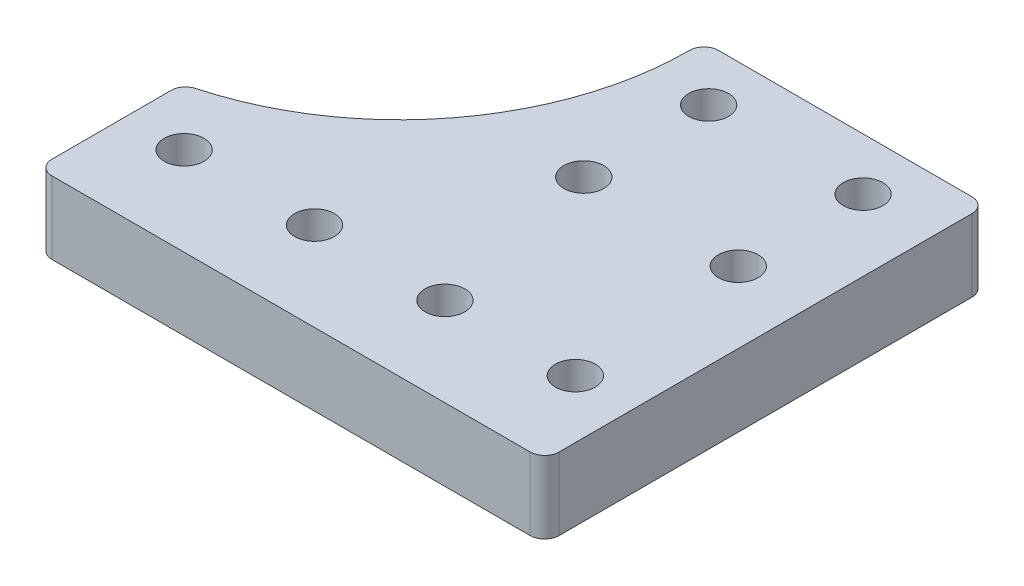
ISO-10303-21;
HEADER;
FILE_DESCRIPTION(('STEP AP214'),'2;1');
FILE_NAME('part.step','',(''),(''),'','','');
FILE_SCHEMA(('AUTOMOTIVE_DESIGN { 1 0 10303 214 1 1 1 1 }'));
ENDSEC;
DATA;
#1=APPLICATION_CONTEXT('core data for automotive mechanical design processes');
#2=APPLICATION_PROTOCOL_DEFINITION('international standard','automotive_design',2000,#1);
#3=PRODUCT_CONTEXT('',#1,'mechanical');
#4=PRODUCT('Part','Part','',(#3));
#5=PRODUCT_RELATED_PRODUCT_CATEGORY('part','',(#4));
#6=PRODUCT_DEFINITION_FORMATION('','',#4);
#7=PRODUCT_DEFINITION_CONTEXT('part definition',#1,'design');
#8=PRODUCT_DEFINITION('design','',#6,#7);
#9=PRODUCT_DEFINITION_SHAPE('','',#8);
#10=(LENGTH_UNIT() NAMED_UNIT(*) SI_UNIT(.MILLI.,.METRE.));
#11=(NAMED_UNIT(*) PLANE_ANGLE_UNIT() SI_UNIT($,.RADIAN.));
#12=(NAMED_UNIT(*) SI_UNIT($,.STERADIAN.) SOLID_ANGLE_UNIT());
#13=UNCERTAINTY_MEASURE_WITH_UNIT(LENGTH_MEASURE(1.E-05),#10,'distance_accuracy_value','');
#14=(GEOMETRIC_REPRESENTATION_CONTEXT(3) GLOBAL_UNCERTAINTY_ASSIGNED_CONTEXT((#13)) GLOBAL_UNIT_ASSIGNED_CONTEXT((#10,
#11,#12)) REPRESENTATION_CONTEXT('',''));
#15=CARTESIAN_POINT('',(0.,0.,0.));
#16=DIRECTION('',(0.,0.,1.));
#17=DIRECTION('',(1.,0.,0.));
#18=AXIS2_PLACEMENT_3D('',#15,#16,#17);
#19=CARTESIAN_POINT('',(0.,10.,-61.));
#20=DIRECTION('',(0.,0.,-1.));
#21=DIRECTION('',(-1.,0.,0.));
#22=AXIS2_PLACEMENT_3D('',#19,#20,#21);
#23=PLANE('',#22);
#24=DIRECTION('',(1.,0.,0.));
#25=VECTOR('',#24,1.);
#26=CARTESIAN_POINT('',(0.,0.,-61.));
#27=LINE('',#26,#25);
#28=CARTESIAN_POINT('',(-37.,0.,-61.));
#29=VERTEX_POINT('',#28);
#30=CARTESIAN_POINT('',(-2.,0.,-61.));
#31=VERTEX_POINT('',#30);
#32=EDGE_CURVE('E137',#29,#31,#27,.T.);
#33=ORIENTED_EDGE('',*,*,#32,.F.);
#34=DIRECTION('',(0.,-1.,0.));
#35=VECTOR('',#34,1.);
#36=CARTESIAN_POINT('',(-37.,10.,-61.));
#37=LINE('',#36,#35);
#38=CARTESIAN_POINT('',(-37.,10.,-61.));
#39=VERTEX_POINT('',#38);
#40=EDGE_CURVE('E183',#29,#39,#37,.F.);
#41=ORIENTED_EDGE('',*,*,#40,.T.);
#42=DIRECTION('',(1.,0.,0.));
#43=VECTOR('',#42,1.);
#44=CARTESIAN_POINT('',(0.,10.,-61.));
#45=LINE('',#44,#43);
#46=CARTESIAN_POINT('',(-2.,10.,-61.));
#47=VERTEX_POINT('',#46);
#48=EDGE_CURVE('E209',#39,#47,#45,.T.);
#49=ORIENTED_EDGE('',*,*,#48,.T.);
#50=DIRECTION('',(0.,-1.,0.));
#51=VECTOR('',#50,1.);
#52=CARTESIAN_POINT('',(-2.,0.,-61.));
#53=LINE('',#52,#51);
#54=EDGE_CURVE('E177',#47,#31,#53,.T.);
#55=ORIENTED_EDGE('',*,*,#54,.T.);
#56=EDGE_LOOP('',(#33,#41,#49,#55));
#57=FACE_BOUND('',#56,.T.);
#58=ADVANCED_FACE('F41',(#57),#23,.T.);
#59=CARTESIAN_POINT('',(-39.,10.,0.));
#60=DIRECTION('',(-1.,0.,0.));
#61=DIRECTION('',(0.,0.,1.));
#62=AXIS2_PLACEMENT_3D('',#59,#60,#61);
#63=PLANE('',#62);
#64=DIRECTION('',(0.,0.,-1.));
#65=VECTOR('',#64,1.);
#66=CARTESIAN_POINT('',(-39.,10.,0.));
#67=LINE('',#66,#65);
#68=CARTESIAN_POINT('',(-39.,10.,-58.9743505398101));
#69=VERTEX_POINT('',#68);
#70=CARTESIAN_POINT('',(-39.,10.,-59.));
#71=VERTEX_POINT('',#70);
#72=EDGE_CURVE('E207',#69,#71,#67,.T.);
#73=ORIENTED_EDGE('',*,*,#72,.T.);
#74=DIRECTION('',(0.,-1.,0.));
#75=VECTOR('',#74,1.);
#76=CARTESIAN_POINT('',(-39.,10.,-59.));
#77=LINE('',#76,#75);
#78=CARTESIAN_POINT('',(-39.,0.,-59.));
#79=VERTEX_POINT('',#78);
#80=EDGE_CURVE('E135',#71,#79,#77,.T.);
#81=ORIENTED_EDGE('',*,*,#80,.T.);
#82=DIRECTION('',(0.,0.,-1.));
#83=VECTOR('',#82,1.);
#84=CARTESIAN_POINT('',(-39.,0.,0.));
#85=LINE('',#84,#83);
#86=CARTESIAN_POINT('',(-39.,0.,-58.9743505398101));
#87=VERTEX_POINT('',#86);
#88=EDGE_CURVE('E124',#87,#79,#85,.T.);
#89=ORIENTED_EDGE('',*,*,#88,.F.);
#90=DIRECTION('',(0.,1.,0.));
#91=VECTOR('',#90,1.);
#92=CARTESIAN_POINT('',(-39.,10.,-58.9743505398101));
#93=LINE('',#92,#91);
#94=EDGE_CURVE('E127',#87,#69,#93,.T.);
#95=ORIENTED_EDGE('',*,*,#94,.T.);
#96=EDGE_LOOP('',(#73,#81,#89,#95));
#97=FACE_BOUND('',#96,.T.);
#98=ADVANCED_FACE('F132',(#97),#63,.T.);
#99=CARTESIAN_POINT('',(-70.,10.,0.));
#100=DIRECTION('',(1.,0.,0.));
#101=DIRECTION('',(0.,0.,-1.));
#102=AXIS2_PLACEMENT_3D('',#99,#100,#101);
#103=PLANE('',#102);
#104=DIRECTION('',(0.,0.,1.));
#105=VECTOR('',#104,1.);
#106=CARTESIAN_POINT('',(-70.,10.,0.));
#107=LINE('',#106,#105);
#108=CARTESIAN_POINT('',(-70.,10.,-18.4404141407877));
#109=VERTEX_POINT('',#108);
#110=CARTESIAN_POINT('',(-70.,10.,-1.99999999999999));
#111=VERTEX_POINT('',#110);
#112=EDGE_CURVE('E194',#109,#111,#107,.T.);
#113=ORIENTED_EDGE('',*,*,#112,.F.);
#114=DIRECTION('',(0.,-1.,0.));
#115=VECTOR('',#114,1.);
#116=CARTESIAN_POINT('',(-70.,10.,-18.4404141407877));
#117=LINE('',#116,#115);
#118=CARTESIAN_POINT('',(-70.,0.,-18.4404141407877));
#119=VERTEX_POINT('',#118);
#120=EDGE_CURVE('E187',#109,#119,#117,.T.);
#121=ORIENTED_EDGE('',*,*,#120,.T.);
#122=DIRECTION('',(0.,0.,1.));
#123=VECTOR('',#122,1.);
#124=CARTESIAN_POINT('',(-70.,0.,0.));
#125=LINE('',#124,#123);
#126=CARTESIAN_POINT('',(-70.,0.,-1.99999999999999));
#127=VERTEX_POINT('',#126);
#128=EDGE_CURVE('E136',#119,#127,#125,.T.);
#129=ORIENTED_EDGE('',*,*,#128,.T.);
#130=DIRECTION('',(0.,-1.,0.));
#131=VECTOR('',#130,1.);
#132=CARTESIAN_POINT('',(-70.,10.,-1.99999999999999));
#133=LINE('',#132,#131);
#134=EDGE_CURVE('E174',#127,#111,#133,.F.);
#135=ORIENTED_EDGE('',*,*,#134,.T.);
#136=EDGE_LOOP('',(#113,#121,#129,#135));
#137=FACE_BOUND('',#136,.T.);
#138=ADVANCED_FACE('F193',(#137),#103,.F.);
#139=CARTESIAN_POINT('',(0.,10.,0.));
#140=DIRECTION('',(0.,0.,1.));
#141=DIRECTION('',(1.,0.,0.));
#142=AXIS2_PLACEMENT_3D('',#139,#140,#141);
#143=PLANE('',#142);
#144=DIRECTION('',(-1.,0.,0.));
#145=VECTOR('',#144,1.);
#146=CARTESIAN_POINT('',(0.,0.,0.));
#147=LINE('',#146,#145);
#148=CARTESIAN_POINT('',(-2.,0.,0.));
#149=VERTEX_POINT('',#148);
#150=CARTESIAN_POINT('',(-68.,0.,0.));
#151=VERTEX_POINT('',#150);
#152=EDGE_CURVE('E199',#149,#151,#147,.T.);
#153=ORIENTED_EDGE('',*,*,#152,.F.);
#154=DIRECTION('',(0.,-1.,0.));
#155=VECTOR('',#154,1.);
#156=CARTESIAN_POINT('',(-2.,10.,0.));
#157=LINE('',#156,#155);
#158=CARTESIAN_POINT('',(-2.,10.,0.));
#159=VERTEX_POINT('',#158);
#160=EDGE_CURVE('E165',#149,#159,#157,.F.);
#161=ORIENTED_EDGE('',*,*,#160,.T.);
#162=DIRECTION('',(-1.,0.,0.));
#163=VECTOR('',#162,1.);
#164=CARTESIAN_POINT('',(0.,10.,0.));
#165=LINE('',#164,#163);
#166=CARTESIAN_POINT('',(-68.,10.,0.));
#167=VERTEX_POINT('',#166);
#168=EDGE_CURVE('E143',#159,#167,#165,.T.);
#169=ORIENTED_EDGE('',*,*,#168,.T.);
#170=DIRECTION('',(0.,-1.,0.));
#171=VECTOR('',#170,1.);
#172=CARTESIAN_POINT('',(-68.,0.,0.));
#173=LINE('',#172,#171);
#174=EDGE_CURVE('E162',#167,#151,#173,.T.);
#175=ORIENTED_EDGE('',*,*,#174,.T.);
#176=EDGE_LOOP('',(#153,#161,#169,#175));
#177=FACE_BOUND('',#176,.T.);
#178=ADVANCED_FACE('F325',(#177),#143,.T.);
#179=CARTESIAN_POINT('',(0.,10.,0.));
#180=DIRECTION('',(-1.,0.,0.));
#181=DIRECTION('',(0.,0.,1.));
#182=AXIS2_PLACEMENT_3D('',#179,#180,#181);
#183=PLANE('',#182);
#184=DIRECTION('',(0.,0.,-1.));
#185=VECTOR('',#184,1.);
#186=CARTESIAN_POINT('',(0.,10.,0.));
#187=LINE('',#186,#185);
#188=CARTESIAN_POINT('',(0.,10.,-2.));
#189=VERTEX_POINT('',#188);
#190=CARTESIAN_POINT('',(0.,10.,-59.));
#191=VERTEX_POINT('',#190);
#192=EDGE_CURVE('E140',#189,#191,#187,.T.);
#193=ORIENTED_EDGE('',*,*,#192,.F.);
#194=DIRECTION('',(0.,-1.,0.));
#195=VECTOR('',#194,1.);
#196=CARTESIAN_POINT('',(0.,0.,-2.));
#197=LINE('',#196,#195);
#198=CARTESIAN_POINT('',(0.,0.,-2.));
#199=VERTEX_POINT('',#198);
#200=EDGE_CURVE('E152',#189,#199,#197,.T.);
#201=ORIENTED_EDGE('',*,*,#200,.T.);
#202=DIRECTION('',(0.,0.,-1.));
#203=VECTOR('',#202,1.);
#204=CARTESIAN_POINT('',(0.,0.,0.));
#205=LINE('',#204,#203);
#206=CARTESIAN_POINT('',(0.,0.,-59.));
#207=VERTEX_POINT('',#206);
#208=EDGE_CURVE('E146',#199,#207,#205,.T.);
#209=ORIENTED_EDGE('',*,*,#208,.T.);
#210=DIRECTION('',(0.,-1.,0.));
#211=VECTOR('',#210,1.);
#212=CARTESIAN_POINT('',(0.,10.,-59.));
#213=LINE('',#212,#211);
#214=EDGE_CURVE('E150',#207,#191,#213,.F.);
#215=ORIENTED_EDGE('',*,*,#214,.T.);
#216=EDGE_LOOP('',(#193,#201,#209,#215));
#217=FACE_BOUND('',#216,.T.);
#218=ADVANCED_FACE('F264',(#217),#183,.F.);
#219=CARTESIAN_POINT('',(0.,10.,0.));
#220=DIRECTION('',(0.,1.,0.));
#221=DIRECTION('',(0.,0.,1.));
#222=AXIS2_PLACEMENT_3D('',#219,#220,#221);
#223=PLANE('',#222);
#224=CARTESIAN_POINT('',(-31.1595849700552,10.,-53.7988812289072));
#225=DIRECTION('',(0.,1.,0.));
#226=DIRECTION('',(0.,0.,1.));
#227=AXIS2_PLACEMENT_3D('',#224,#225,#226);
#228=CIRCLE('',#227,2.75);
#229=CARTESIAN_POINT('',(-31.1595849700552,10.,-51.0488812289072));
#230=VERTEX_POINT('',#229);
#231=EDGE_CURVE('E214',#230,#230,#228,.T.);
#232=ORIENTED_EDGE('',*,*,#231,.F.);
#233=EDGE_LOOP('',(#232));
#234=FACE_BOUND('',#233,.T.);
#235=CARTESIAN_POINT('',(-31.1595849700552,10.,-36.5679523283191));
#236=DIRECTION('',(0.,1.,0.));
#237=DIRECTION('',(0.,0.,1.));
#238=AXIS2_PLACEMENT_3D('',#235,#236,#237);
#239=CIRCLE('',#238,2.75);
#240=CARTESIAN_POINT('',(-31.1595849700552,10.,-33.8179523283191));
#241=VERTEX_POINT('',#240);
#242=EDGE_CURVE('E233',#241,#241,#239,.T.);
#243=ORIENTED_EDGE('',*,*,#242,.F.);
#244=EDGE_LOOP('',(#243));
#245=FACE_BOUND('',#244,.T.);
#246=CARTESIAN_POINT('',(-9.83786555408983,10.,-36.5679523283191));
#247=DIRECTION('',(0.,1.,0.));
#248=DIRECTION('',(0.,0.,1.));
#249=AXIS2_PLACEMENT_3D('',#246,#247,#248);
#250=CIRCLE('',#249,2.75);
#251=CARTESIAN_POINT('',(-9.83786555408983,10.,-33.8179523283191));
#252=VERTEX_POINT('',#251);
#253=EDGE_CURVE('E227',#252,#252,#250,.T.);
#254=ORIENTED_EDGE('',*,*,#253,.F.);
#255=EDGE_LOOP('',(#254));
#256=FACE_BOUND('',#255,.T.);
#257=CARTESIAN_POINT('',(-8.,10.,-12.241109826391));
#258=DIRECTION('',(0.,1.,0.));
#259=DIRECTION('',(0.,0.,1.));
#260=AXIS2_PLACEMENT_3D('',#257,#258,#259);
#261=CIRCLE('',#260,2.75);
#262=CARTESIAN_POINT('',(-8.,10.,-9.49110982639104));
#263=VERTEX_POINT('',#262);
#264=EDGE_CURVE('E220',#263,#263,#261,.T.);
#265=ORIENTED_EDGE('',*,*,#264,.F.);
#266=EDGE_LOOP('',(#265));
#267=FACE_BOUND('',#266,.T.);
#268=CARTESIAN_POINT('',(-26.,10.,-12.241109826391));
#269=DIRECTION('',(0.,1.,0.));
#270=DIRECTION('',(0.,0.,1.));
#271=AXIS2_PLACEMENT_3D('',#268,#269,#270);
#272=CIRCLE('',#271,2.75);
#273=CARTESIAN_POINT('',(-26.,10.,-9.49110982639104));
#274=VERTEX_POINT('',#273);
#275=EDGE_CURVE('E221',#274,#274,#272,.T.);
#276=ORIENTED_EDGE('',*,*,#275,.F.);
#277=EDGE_LOOP('',(#276));
#278=FACE_BOUND('',#277,.T.);
#279=CARTESIAN_POINT('',(-44.,10.,-12.241109826391));
#280=DIRECTION('',(0.,1.,0.));
#281=DIRECTION('',(0.,0.,1.));
#282=AXIS2_PLACEMENT_3D('',#279,#280,#281);
#283=CIRCLE('',#282,2.74999999999999);
#284=CARTESIAN_POINT('',(-44.,10.,-9.49110982639105));
#285=VERTEX_POINT('',#284);
#286=EDGE_CURVE('E250',#285,#285,#283,.T.);
#287=ORIENTED_EDGE('',*,*,#286,.F.);
#288=EDGE_LOOP('',(#287));
#289=FACE_BOUND('',#288,.T.);
#290=CARTESIAN_POINT('',(-62.,10.,-12.241109826391));
#291=DIRECTION('',(0.,1.,0.));
#292=DIRECTION('',(0.,0.,1.));
#293=AXIS2_PLACEMENT_3D('',#290,#291,#292);
#294=CIRCLE('',#293,2.75);
#295=CARTESIAN_POINT('',(-62.,10.,-9.49110982639104));
#296=VERTEX_POINT('',#295);
#297=EDGE_CURVE('E244',#296,#296,#294,.T.);
#298=ORIENTED_EDGE('',*,*,#297,.F.);
#299=EDGE_LOOP('',(#298));
#300=FACE_BOUND('',#299,.T.);
#301=CARTESIAN_POINT('',(-9.83786555408983,10.,-53.7988812289072));
#302=DIRECTION('',(0.,1.,0.));
#303=DIRECTION('',(0.,0.,1.));
#304=AXIS2_PLACEMENT_3D('',#301,#302,#303);
#305=CIRCLE('',#304,2.75);
#306=CARTESIAN_POINT('',(-9.83786555408983,10.,-51.0488812289072));
#307=VERTEX_POINT('',#306);
#308=EDGE_CURVE('E211',#307,#307,#305,.T.);
#309=ORIENTED_EDGE('',*,*,#308,.F.);
#310=EDGE_LOOP('',(#309));
#311=FACE_BOUND('',#310,.T.);
#312=CARTESIAN_POINT('',(-79.,10.,-58.9743505398101));
#313=DIRECTION('',(0.,1.,0.));
#314=DIRECTION('',(0.,0.,1.));
#315=AXIS2_PLACEMENT_3D('',#312,#313,#314);
#316=CIRCLE('',#315,40.);
#317=CARTESIAN_POINT('',(-68.5238095238095,10.,-20.3706015883602));
#318=VERTEX_POINT('',#317);
#319=EDGE_CURVE('E126',#69,#318,#316,.F.);
#320=ORIENTED_EDGE('',*,*,#319,.T.);
#321=CARTESIAN_POINT('',(-68.,10.,-18.4404141407877));
#322=DIRECTION('',(0.,1.,0.));
#323=DIRECTION('',(0.,0.,1.));
#324=AXIS2_PLACEMENT_3D('',#321,#322,#323);
#325=CIRCLE('',#324,2.);
#326=EDGE_CURVE('E11',#318,#109,#325,.T.);
#327=ORIENTED_EDGE('',*,*,#326,.T.);
#328=ORIENTED_EDGE('',*,*,#112,.T.);
#329=CARTESIAN_POINT('',(-68.,10.,-1.99999999999999));
#330=DIRECTION('',(0.,1.,0.));
#331=DIRECTION('',(0.,0.,1.));
#332=AXIS2_PLACEMENT_3D('',#329,#330,#331);
#333=CIRCLE('',#332,2.);
#334=EDGE_CURVE('E170',#111,#167,#333,.T.);
#335=ORIENTED_EDGE('',*,*,#334,.T.);
#336=ORIENTED_EDGE('',*,*,#168,.F.);
#337=CARTESIAN_POINT('',(-2.,10.,-2.));
#338=DIRECTION('',(0.,1.,0.));
#339=DIRECTION('',(0.,0.,1.));
#340=AXIS2_PLACEMENT_3D('',#337,#338,#339);
#341=CIRCLE('',#340,2.);
#342=EDGE_CURVE('E172',#159,#189,#341,.T.);
#343=ORIENTED_EDGE('',*,*,#342,.T.);
#344=ORIENTED_EDGE('',*,*,#192,.T.);
#345=CARTESIAN_POINT('',(-2.,10.,-59.));
#346=DIRECTION('',(0.,1.,0.));
#347=DIRECTION('',(0.,0.,1.));
#348=AXIS2_PLACEMENT_3D('',#345,#346,#347);
#349=CIRCLE('',#348,2.);
#350=EDGE_CURVE('E167',#191,#47,#349,.T.);
#351=ORIENTED_EDGE('',*,*,#350,.T.);
#352=ORIENTED_EDGE('',*,*,#48,.F.);
#353=CARTESIAN_POINT('',(-37.,10.,-59.));
#354=DIRECTION('',(0.,1.,0.));
#355=DIRECTION('',(0.,0.,1.));
#356=AXIS2_PLACEMENT_3D('',#353,#354,#355);
#357=CIRCLE('',#356,2.);
#358=EDGE_CURVE('E185',#39,#71,#357,.T.);
#359=ORIENTED_EDGE('',*,*,#358,.T.);
#360=ORIENTED_EDGE('',*,*,#72,.F.);
#361=EDGE_LOOP('',(#320,#327,#328,#335,#336,#343,#344,#351,#352,#359,#360));
#362=FACE_BOUND('',#361,.T.);
#363=ADVANCED_FACE('F261',(#234,#245,#256,#267,#278,#289,#300,#311,#362),#223,.T.);
#364=CARTESIAN_POINT('',(0.,0.,0.));
#365=DIRECTION('',(0.,1.,0.));
#366=DIRECTION('',(0.,0.,1.));
#367=AXIS2_PLACEMENT_3D('',#364,#365,#366);
#368=PLANE('',#367);
#369=CARTESIAN_POINT('',(-31.1595849700552,0.,-53.7988812289072));
#370=DIRECTION('',(0.,1.,0.));
#371=DIRECTION('',(0.,0.,1.));
#372=AXIS2_PLACEMENT_3D('',#369,#370,#371);
#373=CIRCLE('',#372,2.75);
#374=CARTESIAN_POINT('',(-31.1595849700552,0.,-51.0488812289072));
#375=VERTEX_POINT('',#374);
#376=EDGE_CURVE('E236',#375,#375,#373,.T.);
#377=ORIENTED_EDGE('',*,*,#376,.T.);
#378=EDGE_LOOP('',(#377));
#379=FACE_BOUND('',#378,.T.);
#380=CARTESIAN_POINT('',(-31.1595849700552,0.,-36.5679523283191));
#381=DIRECTION('',(0.,1.,0.));
#382=DIRECTION('',(0.,0.,1.));
#383=AXIS2_PLACEMENT_3D('',#380,#381,#382);
#384=CIRCLE('',#383,2.75);
#385=CARTESIAN_POINT('',(-31.1595849700552,0.,-33.8179523283191));
#386=VERTEX_POINT('',#385);
#387=EDGE_CURVE('E230',#386,#386,#384,.T.);
#388=ORIENTED_EDGE('',*,*,#387,.T.);
#389=EDGE_LOOP('',(#388));
#390=FACE_BOUND('',#389,.T.);
#391=CARTESIAN_POINT('',(-9.83786555408983,0.,-36.5679523283191));
#392=DIRECTION('',(0.,1.,0.));
#393=DIRECTION('',(0.,0.,1.));
#394=AXIS2_PLACEMENT_3D('',#391,#392,#393);
#395=CIRCLE('',#394,2.75);
#396=CARTESIAN_POINT('',(-9.83786555408983,0.,-33.8179523283191));
#397=VERTEX_POINT('',#396);
#398=EDGE_CURVE('E224',#397,#397,#395,.T.);
#399=ORIENTED_EDGE('',*,*,#398,.T.);
#400=EDGE_LOOP('',(#399));
#401=FACE_BOUND('',#400,.T.);
#402=CARTESIAN_POINT('',(-8.,0.,-12.241109826391));
#403=DIRECTION('',(0.,1.,0.));
#404=DIRECTION('',(0.,0.,1.));
#405=AXIS2_PLACEMENT_3D('',#402,#403,#404);
#406=CIRCLE('',#405,2.75);
#407=CARTESIAN_POINT('',(-8.,0.,-9.49110982639104));
#408=VERTEX_POINT('',#407);
#409=EDGE_CURVE('E217',#408,#408,#406,.T.);
#410=ORIENTED_EDGE('',*,*,#409,.T.);
#411=EDGE_LOOP('',(#410));
#412=FACE_BOUND('',#411,.T.);
#413=CARTESIAN_POINT('',(-26.,0.,-12.241109826391));
#414=DIRECTION('',(0.,1.,0.));
#415=DIRECTION('',(0.,0.,1.));
#416=AXIS2_PLACEMENT_3D('',#413,#414,#415);
#417=CIRCLE('',#416,2.75);
#418=CARTESIAN_POINT('',(-26.,0.,-9.49110982639104));
#419=VERTEX_POINT('',#418);
#420=EDGE_CURVE('E253',#419,#419,#417,.T.);
#421=ORIENTED_EDGE('',*,*,#420,.T.);
#422=EDGE_LOOP('',(#421));
#423=FACE_BOUND('',#422,.T.);
#424=CARTESIAN_POINT('',(-44.,0.,-12.241109826391));
#425=DIRECTION('',(0.,1.,0.));
#426=DIRECTION('',(0.,0.,1.));
#427=AXIS2_PLACEMENT_3D('',#424,#425,#426);
#428=CIRCLE('',#427,2.74999999999999);
#429=CARTESIAN_POINT('',(-44.,0.,-9.49110982639105));
#430=VERTEX_POINT('',#429);
#431=EDGE_CURVE('E247',#430,#430,#428,.T.);
#432=ORIENTED_EDGE('',*,*,#431,.T.);
#433=EDGE_LOOP('',(#432));
#434=FACE_BOUND('',#433,.T.);
#435=CARTESIAN_POINT('',(-62.,0.,-12.241109826391));
#436=DIRECTION('',(0.,1.,0.));
#437=DIRECTION('',(0.,0.,1.));
#438=AXIS2_PLACEMENT_3D('',#435,#436,#437);
#439=CIRCLE('',#438,2.75);
#440=CARTESIAN_POINT('',(-62.,0.,-9.49110982639104));
#441=VERTEX_POINT('',#440);
#442=EDGE_CURVE('E241',#441,#441,#439,.T.);
#443=ORIENTED_EDGE('',*,*,#442,.T.);
#444=EDGE_LOOP('',(#443));
#445=FACE_BOUND('',#444,.T.);
#446=CARTESIAN_POINT('',(-9.83786555408983,0.,-53.7988812289072));
#447=DIRECTION('',(0.,1.,0.));
#448=DIRECTION('',(0.,0.,1.));
#449=AXIS2_PLACEMENT_3D('',#446,#447,#448);
#450=CIRCLE('',#449,2.75);
#451=CARTESIAN_POINT('',(-9.83786555408983,0.,-51.0488812289072));
#452=VERTEX_POINT('',#451);
#453=EDGE_CURVE('E202',#452,#452,#450,.T.);
#454=ORIENTED_EDGE('',*,*,#453,.T.);
#455=EDGE_LOOP('',(#454));
#456=FACE_BOUND('',#455,.T.);
#457=ORIENTED_EDGE('',*,*,#128,.F.);
#458=CARTESIAN_POINT('',(-68.,0.,-18.4404141407877));
#459=DIRECTION('',(0.,1.,0.));
#460=DIRECTION('',(0.,0.,1.));
#461=AXIS2_PLACEMENT_3D('',#458,#459,#460);
#462=CIRCLE('',#461,2.);
#463=CARTESIAN_POINT('',(-68.5238095238095,0.,-20.3706015883602));
#464=VERTEX_POINT('',#463);
#465=EDGE_CURVE('E63',#119,#464,#462,.F.);
#466=ORIENTED_EDGE('',*,*,#465,.T.);
#467=CARTESIAN_POINT('',(-79.,0.,-58.9743505398101));
#468=DIRECTION('',(0.,1.,0.));
#469=DIRECTION('',(0.,0.,1.));
#470=AXIS2_PLACEMENT_3D('',#467,#468,#469);
#471=CIRCLE('',#470,40.);
#472=EDGE_CURVE('E121',#464,#87,#471,.T.);
#473=ORIENTED_EDGE('',*,*,#472,.T.);
#474=ORIENTED_EDGE('',*,*,#88,.T.);
#475=CARTESIAN_POINT('',(-37.,0.,-59.));
#476=DIRECTION('',(0.,1.,0.));
#477=DIRECTION('',(0.,0.,1.));
#478=AXIS2_PLACEMENT_3D('',#475,#476,#477);
#479=CIRCLE('',#478,2.);
#480=EDGE_CURVE('E181',#79,#29,#479,.F.);
#481=ORIENTED_EDGE('',*,*,#480,.T.);
#482=ORIENTED_EDGE('',*,*,#32,.T.);
#483=CARTESIAN_POINT('',(-2.,0.,-59.));
#484=DIRECTION('',(0.,1.,0.));
#485=DIRECTION('',(0.,0.,1.));
#486=AXIS2_PLACEMENT_3D('',#483,#484,#485);
#487=CIRCLE('',#486,2.);
#488=EDGE_CURVE('E155',#31,#207,#487,.F.);
#489=ORIENTED_EDGE('',*,*,#488,.T.);
#490=ORIENTED_EDGE('',*,*,#208,.F.);
#491=CARTESIAN_POINT('',(-2.,0.,-2.));
#492=DIRECTION('',(0.,1.,0.));
#493=DIRECTION('',(0.,0.,1.));
#494=AXIS2_PLACEMENT_3D('',#491,#492,#493);
#495=CIRCLE('',#494,2.);
#496=EDGE_CURVE('E160',#199,#149,#495,.F.);
#497=ORIENTED_EDGE('',*,*,#496,.T.);
#498=ORIENTED_EDGE('',*,*,#152,.T.);
#499=CARTESIAN_POINT('',(-68.,0.,-1.99999999999999));
#500=DIRECTION('',(0.,1.,0.));
#501=DIRECTION('',(0.,0.,1.));
#502=AXIS2_PLACEMENT_3D('',#499,#500,#501);
#503=CIRCLE('',#502,2.);
#504=EDGE_CURVE('E157',#151,#127,#503,.F.);
#505=ORIENTED_EDGE('',*,*,#504,.T.);
#506=EDGE_LOOP('',(#457,#466,#473,#474,#481,#482,#489,#490,#497,#498,#505));
#507=FACE_BOUND('',#506,.T.);
#508=ADVANCED_FACE('F123',(#379,#390,#401,#412,#423,#434,#445,#456,#507),#368,.F.);
#509=CARTESIAN_POINT('',(-79.,10.,-58.9743505398101));
#510=DIRECTION('',(0.,-1.,0.));
#511=DIRECTION('',(0.,0.,-1.));
#512=AXIS2_PLACEMENT_3D('',#509,#510,#511);
#513=CYLINDRICAL_SURFACE('',#512,40.);
#514=ORIENTED_EDGE('',*,*,#472,.F.);
#515=DIRECTION('',(0.,-1.,0.));
#516=VECTOR('',#515,1.);
#517=CARTESIAN_POINT('',(-68.5238095238095,10.,-20.3706015883602));
#518=LINE('',#517,#516);
#519=EDGE_CURVE('E49',#464,#318,#518,.F.);
#520=ORIENTED_EDGE('',*,*,#519,.T.);
#521=ORIENTED_EDGE('',*,*,#319,.F.);
#522=ORIENTED_EDGE('',*,*,#94,.F.);
#523=EDGE_LOOP('',(#514,#520,#521,#522));
#524=FACE_BOUND('',#523,.T.);
#525=ADVANCED_FACE('F139',(#524),#513,.F.);
#526=CARTESIAN_POINT('',(-2.,10.,-2.));
#527=DIRECTION('',(0.,1.,0.));
#528=DIRECTION('',(0.,0.,1.));
#529=AXIS2_PLACEMENT_3D('',#526,#527,#528);
#530=CYLINDRICAL_SURFACE('',#529,2.);
#531=ORIENTED_EDGE('',*,*,#342,.F.);
#532=ORIENTED_EDGE('',*,*,#160,.F.);
#533=ORIENTED_EDGE('',*,*,#496,.F.);
#534=ORIENTED_EDGE('',*,*,#200,.F.);
#535=EDGE_LOOP('',(#531,#532,#533,#534));
#536=FACE_BOUND('',#535,.T.);
#537=ADVANCED_FACE('F298',(#536),#530,.T.);
#538=CARTESIAN_POINT('',(-68.,10.,-1.99999999999999));
#539=DIRECTION('',(0.,1.,0.));
#540=DIRECTION('',(0.,0.,1.));
#541=AXIS2_PLACEMENT_3D('',#538,#539,#540);
#542=CYLINDRICAL_SURFACE('',#541,2.);
#543=ORIENTED_EDGE('',*,*,#334,.F.);
#544=ORIENTED_EDGE('',*,*,#134,.F.);
#545=ORIENTED_EDGE('',*,*,#504,.F.);
#546=ORIENTED_EDGE('',*,*,#174,.F.);
#547=EDGE_LOOP('',(#543,#544,#545,#546));
#548=FACE_BOUND('',#547,.T.);
#549=ADVANCED_FACE('F301',(#548),#542,.T.);
#550=CARTESIAN_POINT('',(-2.,10.,-59.));
#551=DIRECTION('',(0.,1.,0.));
#552=DIRECTION('',(0.,0.,1.));
#553=AXIS2_PLACEMENT_3D('',#550,#551,#552);
#554=CYLINDRICAL_SURFACE('',#553,2.);
#555=ORIENTED_EDGE('',*,*,#350,.F.);
#556=ORIENTED_EDGE('',*,*,#214,.F.);
#557=ORIENTED_EDGE('',*,*,#488,.F.);
#558=ORIENTED_EDGE('',*,*,#54,.F.);
#559=EDGE_LOOP('',(#555,#556,#557,#558));
#560=FACE_BOUND('',#559,.T.);
#561=ADVANCED_FACE('F284',(#560),#554,.T.);
#562=CARTESIAN_POINT('',(-37.,10.,-59.));
#563=DIRECTION('',(0.,-1.,0.));
#564=DIRECTION('',(0.,0.,-1.));
#565=AXIS2_PLACEMENT_3D('',#562,#563,#564);
#566=CYLINDRICAL_SURFACE('',#565,2.);
#567=ORIENTED_EDGE('',*,*,#358,.F.);
#568=ORIENTED_EDGE('',*,*,#40,.F.);
#569=ORIENTED_EDGE('',*,*,#480,.F.);
#570=ORIENTED_EDGE('',*,*,#80,.F.);
#571=EDGE_LOOP('',(#567,#568,#569,#570));
#572=FACE_BOUND('',#571,.T.);
#573=ADVANCED_FACE('F275',(#572),#566,.T.);
#574=CARTESIAN_POINT('',(-68.,10.,-18.4404141407877));
#575=DIRECTION('',(0.,-1.,0.));
#576=DIRECTION('',(0.,0.,-1.));
#577=AXIS2_PLACEMENT_3D('',#574,#575,#576);
#578=CYLINDRICAL_SURFACE('',#577,2.);
#579=ORIENTED_EDGE('',*,*,#326,.F.);
#580=ORIENTED_EDGE('',*,*,#519,.F.);
#581=ORIENTED_EDGE('',*,*,#465,.F.);
#582=ORIENTED_EDGE('',*,*,#120,.F.);
#583=EDGE_LOOP('',(#579,#580,#581,#582));
#584=FACE_BOUND('',#583,.T.);
#585=ADVANCED_FACE('F43',(#584),#578,.T.);
#586=CARTESIAN_POINT('',(-9.83786555408983,0.,-53.7988812289072));
#587=DIRECTION('',(0.,1.,0.));
#588=DIRECTION('',(0.,0.,1.));
#589=AXIS2_PLACEMENT_3D('',#586,#587,#588);
#590=CYLINDRICAL_SURFACE('',#589,2.75);
#591=ORIENTED_EDGE('',*,*,#453,.F.);
#592=EDGE_LOOP('',(#591));
#593=FACE_BOUND('',#592,.T.);
#594=ORIENTED_EDGE('',*,*,#308,.T.);
#595=EDGE_LOOP('',(#594));
#596=FACE_BOUND('',#595,.T.);
#597=ADVANCED_FACE('F274',(#593,#596),#590,.F.);
#598=CARTESIAN_POINT('',(-62.,0.,-12.241109826391));
#599=DIRECTION('',(0.,1.,0.));
#600=DIRECTION('',(0.,0.,1.));
#601=AXIS2_PLACEMENT_3D('',#598,#599,#600);
#602=CYLINDRICAL_SURFACE('',#601,2.75);
#603=ORIENTED_EDGE('',*,*,#442,.F.);
#604=EDGE_LOOP('',(#603));
#605=FACE_BOUND('',#604,.T.);
#606=ORIENTED_EDGE('',*,*,#297,.T.);
#607=EDGE_LOOP('',(#606));
#608=FACE_BOUND('',#607,.T.);
#609=ADVANCED_FACE('F280',(#605,#608),#602,.F.);
#610=CARTESIAN_POINT('',(-44.,0.,-12.241109826391));
#611=DIRECTION('',(0.,1.,0.));
#612=DIRECTION('',(0.,0.,1.));
#613=AXIS2_PLACEMENT_3D('',#610,#611,#612);
#614=CYLINDRICAL_SURFACE('',#613,2.74999999999999);
#615=ORIENTED_EDGE('',*,*,#431,.F.);
#616=EDGE_LOOP('',(#615));
#617=FACE_BOUND('',#616,.T.);
#618=ORIENTED_EDGE('',*,*,#286,.T.);
#619=EDGE_LOOP('',(#618));
#620=FACE_BOUND('',#619,.T.);
#621=ADVANCED_FACE('F357',(#617,#620),#614,.F.);
#622=CARTESIAN_POINT('',(-26.,0.,-12.241109826391));
#623=DIRECTION('',(0.,1.,0.));
#624=DIRECTION('',(0.,0.,1.));
#625=AXIS2_PLACEMENT_3D('',#622,#623,#624);
#626=CYLINDRICAL_SURFACE('',#625,2.75);
#627=ORIENTED_EDGE('',*,*,#420,.F.);
#628=EDGE_LOOP('',(#627));
#629=FACE_BOUND('',#628,.T.);
#630=ORIENTED_EDGE('',*,*,#275,.T.);
#631=EDGE_LOOP('',(#630));
#632=FACE_BOUND('',#631,.T.);
#633=ADVANCED_FACE('F259',(#629,#632),#626,.F.);
#634=CARTESIAN_POINT('',(-8.,0.,-12.241109826391));
#635=DIRECTION('',(0.,1.,0.));
#636=DIRECTION('',(0.,0.,1.));
#637=AXIS2_PLACEMENT_3D('',#634,#635,#636);
#638=CYLINDRICAL_SURFACE('',#637,2.75);
#639=ORIENTED_EDGE('',*,*,#409,.F.);
#640=EDGE_LOOP('',(#639));
#641=FACE_BOUND('',#640,.T.);
#642=ORIENTED_EDGE('',*,*,#264,.T.);
#643=EDGE_LOOP('',(#642));
#644=FACE_BOUND('',#643,.T.);
#645=ADVANCED_FACE('F339',(#641,#644),#638,.F.);
#646=CARTESIAN_POINT('',(-9.83786555408983,0.,-36.5679523283191));
#647=DIRECTION('',(0.,1.,0.));
#648=DIRECTION('',(0.,0.,1.));
#649=AXIS2_PLACEMENT_3D('',#646,#647,#648);
#650=CYLINDRICAL_SURFACE('',#649,2.75);
#651=ORIENTED_EDGE('',*,*,#398,.F.);
#652=EDGE_LOOP('',(#651));
#653=FACE_BOUND('',#652,.T.);
#654=ORIENTED_EDGE('',*,*,#253,.T.);
#655=EDGE_LOOP('',(#654));
#656=FACE_BOUND('',#655,.T.);
#657=ADVANCED_FACE('F342',(#653,#656),#650,.F.);
#658=CARTESIAN_POINT('',(-31.1595849700552,0.,-36.5679523283191));
#659=DIRECTION('',(0.,1.,0.));
#660=DIRECTION('',(0.,0.,1.));
#661=AXIS2_PLACEMENT_3D('',#658,#659,#660);
#662=CYLINDRICAL_SURFACE('',#661,2.75);
#663=ORIENTED_EDGE('',*,*,#387,.F.);
#664=EDGE_LOOP('',(#663));
#665=FACE_BOUND('',#664,.T.);
#666=ORIENTED_EDGE('',*,*,#242,.T.);
#667=EDGE_LOOP('',(#666));
#668=FACE_BOUND('',#667,.T.);
#669=ADVANCED_FACE('F346',(#665,#668),#662,.F.);
#670=CARTESIAN_POINT('',(-31.1595849700552,0.,-53.7988812289072));
#671=DIRECTION('',(0.,1.,0.));
#672=DIRECTION('',(0.,0.,1.));
#673=AXIS2_PLACEMENT_3D('',#670,#671,#672);
#674=CYLINDRICAL_SURFACE('',#673,2.75);
#675=ORIENTED_EDGE('',*,*,#376,.F.);
#676=EDGE_LOOP('',(#675));
#677=FACE_BOUND('',#676,.T.);
#678=ORIENTED_EDGE('',*,*,#231,.T.);
#679=EDGE_LOOP('',(#678));
#680=FACE_BOUND('',#679,.T.);
#681=ADVANCED_FACE('F350',(#677,#680),#674,.F.);
#682=CLOSED_SHELL('',(#58,#98,#138,#178,#218,#363,#508,#525,#537,#549,#561,#573,#585,#597,#609,
#621,#633,#645,#657,#669,#681));
#683=MANIFOLD_SOLID_BREP('B2',#682);
#684=ADVANCED_BREP_SHAPE_REPRESENTATION('',(#18,#683),#14);
#685=SHAPE_DEFINITION_REPRESENTATION(#9,#684);
ENDSEC;
END-ISO-10303-21;
